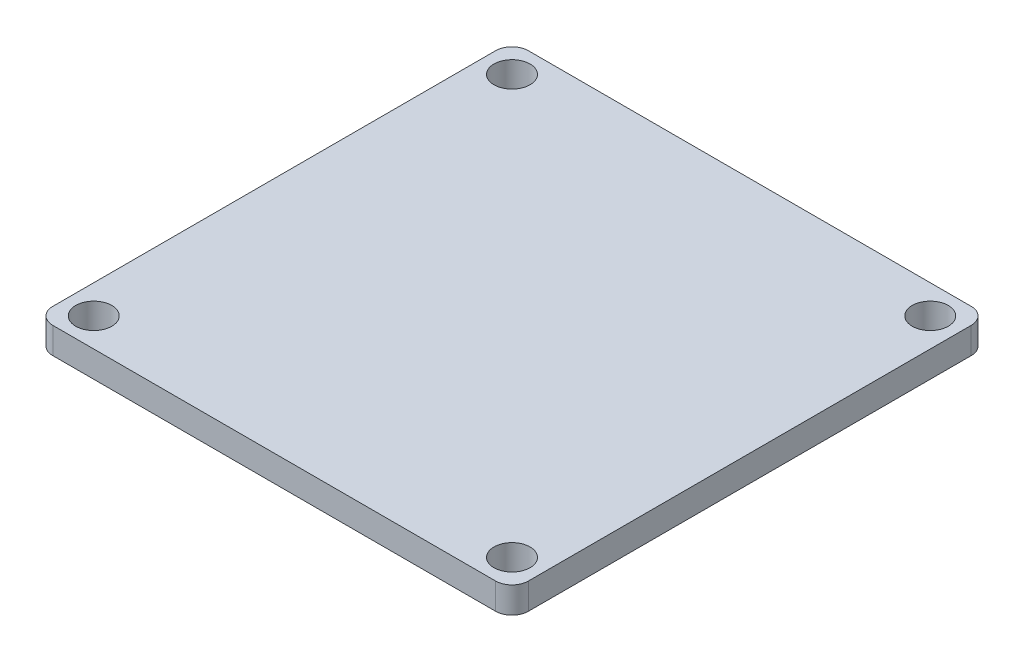
ISO-10303-21;
HEADER;
FILE_DESCRIPTION(('STEP AP214'),'2;1');
FILE_NAME('part.step','',(''),(''),'','','');
FILE_SCHEMA(('AUTOMOTIVE_DESIGN { 1 0 10303 214 1 1 1 1 }'));
ENDSEC;
DATA;
#1=APPLICATION_CONTEXT('core data for automotive mechanical design processes');
#2=APPLICATION_PROTOCOL_DEFINITION('international standard','automotive_design',2000,#1);
#3=PRODUCT_CONTEXT('',#1,'mechanical');
#4=PRODUCT('Part','Part','',(#3));
#5=PRODUCT_RELATED_PRODUCT_CATEGORY('part','',(#4));
#6=PRODUCT_DEFINITION_FORMATION('','',#4);
#7=PRODUCT_DEFINITION_CONTEXT('part definition',#1,'design');
#8=PRODUCT_DEFINITION('design','',#6,#7);
#9=PRODUCT_DEFINITION_SHAPE('','',#8);
#10=(LENGTH_UNIT() NAMED_UNIT(*) SI_UNIT(.MILLI.,.METRE.));
#11=(NAMED_UNIT(*) PLANE_ANGLE_UNIT() SI_UNIT($,.RADIAN.));
#12=(NAMED_UNIT(*) SI_UNIT($,.STERADIAN.) SOLID_ANGLE_UNIT());
#13=UNCERTAINTY_MEASURE_WITH_UNIT(LENGTH_MEASURE(1.E-05),#10,'distance_accuracy_value','');
#14=(GEOMETRIC_REPRESENTATION_CONTEXT(3) GLOBAL_UNCERTAINTY_ASSIGNED_CONTEXT((#13)) GLOBAL_UNIT_ASSIGNED_CONTEXT((#10,
#11,#12)) REPRESENTATION_CONTEXT('',''));
#15=CARTESIAN_POINT('',(0.,0.,0.));
#16=DIRECTION('',(0.,0.,1.));
#17=DIRECTION('',(1.,0.,0.));
#18=AXIS2_PLACEMENT_3D('',#15,#16,#17);
#19=CARTESIAN_POINT('',(0.,1.6,0.));
#20=DIRECTION('',(0.,-1.,0.));
#21=DIRECTION('',(0.,0.,-1.));
#22=AXIS2_PLACEMENT_3D('',#19,#20,#21);
#23=PLANE('',#22);
#24=DIRECTION('',(-1.,0.,0.));
#25=VECTOR('',#24,1.);
#26=CARTESIAN_POINT('',(-14.5,1.6,-14.5));
#27=LINE('',#26,#25);
#28=CARTESIAN_POINT('',(13.5,1.6,-14.5));
#29=VERTEX_POINT('',#28);
#30=CARTESIAN_POINT('',(-13.5,1.6,-14.5));
#31=VERTEX_POINT('',#30);
#32=EDGE_CURVE('E172',#29,#31,#27,.T.);
#33=ORIENTED_EDGE('',*,*,#32,.T.);
#34=CARTESIAN_POINT('',(-13.5,1.6,-13.5));
#35=DIRECTION('',(0.,-1.,0.));
#36=DIRECTION('',(0.,0.,-1.));
#37=AXIS2_PLACEMENT_3D('',#34,#35,#36);
#38=CIRCLE('',#37,1.);
#39=CARTESIAN_POINT('',(-14.5,1.6,-13.5));
#40=VERTEX_POINT('',#39);
#41=EDGE_CURVE('E150',#31,#40,#38,.F.);
#42=ORIENTED_EDGE('',*,*,#41,.T.);
#43=DIRECTION('',(0.,0.,1.));
#44=VECTOR('',#43,1.);
#45=CARTESIAN_POINT('',(-14.5,1.6,14.5));
#46=LINE('',#45,#44);
#47=CARTESIAN_POINT('',(-14.5,1.6,13.5));
#48=VERTEX_POINT('',#47);
#49=EDGE_CURVE('E120',#40,#48,#46,.T.);
#50=ORIENTED_EDGE('',*,*,#49,.T.);
#51=CARTESIAN_POINT('',(-13.5,1.6,13.5));
#52=DIRECTION('',(0.,-1.,0.));
#53=DIRECTION('',(0.,0.,-1.));
#54=AXIS2_PLACEMENT_3D('',#51,#52,#53);
#55=CIRCLE('',#54,1.);
#56=CARTESIAN_POINT('',(-13.5,1.6,14.5));
#57=VERTEX_POINT('',#56);
#58=EDGE_CURVE('E56',#48,#57,#55,.F.);
#59=ORIENTED_EDGE('',*,*,#58,.T.);
#60=DIRECTION('',(1.,0.,0.));
#61=VECTOR('',#60,1.);
#62=CARTESIAN_POINT('',(-14.5,1.6,14.5));
#63=LINE('',#62,#61);
#64=CARTESIAN_POINT('',(13.5,1.6,14.5));
#65=VERTEX_POINT('',#64);
#66=EDGE_CURVE('E136',#57,#65,#63,.T.);
#67=ORIENTED_EDGE('',*,*,#66,.T.);
#68=CARTESIAN_POINT('',(13.5,1.6,13.5));
#69=DIRECTION('',(0.,-1.,0.));
#70=DIRECTION('',(0.,0.,-1.));
#71=AXIS2_PLACEMENT_3D('',#68,#69,#70);
#72=CIRCLE('',#71,1.);
#73=CARTESIAN_POINT('',(14.5,1.6,13.5));
#74=VERTEX_POINT('',#73);
#75=EDGE_CURVE('E146',#65,#74,#72,.F.);
#76=ORIENTED_EDGE('',*,*,#75,.T.);
#77=DIRECTION('',(0.,0.,-1.));
#78=VECTOR('',#77,1.);
#79=CARTESIAN_POINT('',(14.5,1.6,14.5));
#80=LINE('',#79,#78);
#81=CARTESIAN_POINT('',(14.5,1.6,-13.5));
#82=VERTEX_POINT('',#81);
#83=EDGE_CURVE('E130',#74,#82,#80,.T.);
#84=ORIENTED_EDGE('',*,*,#83,.T.);
#85=CARTESIAN_POINT('',(13.5,1.6,-13.5));
#86=DIRECTION('',(0.,-1.,0.));
#87=DIRECTION('',(0.,0.,-1.));
#88=AXIS2_PLACEMENT_3D('',#85,#86,#87);
#89=CIRCLE('',#88,1.);
#90=EDGE_CURVE('E148',#82,#29,#89,.F.);
#91=ORIENTED_EDGE('',*,*,#90,.T.);
#92=EDGE_LOOP('',(#33,#42,#50,#59,#67,#76,#84,#91));
#93=FACE_BOUND('',#92,.T.);
#94=CARTESIAN_POINT('',(-12.75,1.6,-12.75));
#95=DIRECTION('',(0.,1.,0.));
#96=DIRECTION('',(0.,0.,1.));
#97=AXIS2_PLACEMENT_3D('',#94,#95,#96);
#98=CIRCLE('',#97,1.1);
#99=CARTESIAN_POINT('',(-12.75,1.6,-11.65));
#100=VERTEX_POINT('',#99);
#101=EDGE_CURVE('E181',#100,#100,#98,.T.);
#102=ORIENTED_EDGE('',*,*,#101,.F.);
#103=EDGE_LOOP('',(#102));
#104=FACE_BOUND('',#103,.T.);
#105=CARTESIAN_POINT('',(12.75,1.6,-12.75));
#106=DIRECTION('',(0.,1.,0.));
#107=DIRECTION('',(0.,0.,1.));
#108=AXIS2_PLACEMENT_3D('',#105,#106,#107);
#109=CIRCLE('',#108,1.1);
#110=CARTESIAN_POINT('',(12.75,1.6,-11.65));
#111=VERTEX_POINT('',#110);
#112=EDGE_CURVE('E186',#111,#111,#109,.T.);
#113=ORIENTED_EDGE('',*,*,#112,.F.);
#114=EDGE_LOOP('',(#113));
#115=FACE_BOUND('',#114,.T.);
#116=CARTESIAN_POINT('',(12.75,1.6,12.75));
#117=DIRECTION('',(0.,1.,0.));
#118=DIRECTION('',(0.,0.,1.));
#119=AXIS2_PLACEMENT_3D('',#116,#117,#118);
#120=CIRCLE('',#119,1.1);
#121=CARTESIAN_POINT('',(12.75,1.6,13.85));
#122=VERTEX_POINT('',#121);
#123=EDGE_CURVE('E191',#122,#122,#120,.T.);
#124=ORIENTED_EDGE('',*,*,#123,.F.);
#125=EDGE_LOOP('',(#124));
#126=FACE_BOUND('',#125,.T.);
#127=CARTESIAN_POINT('',(-12.75,1.6,12.75));
#128=DIRECTION('',(0.,1.,0.));
#129=DIRECTION('',(0.,0.,1.));
#130=AXIS2_PLACEMENT_3D('',#127,#128,#129);
#131=CIRCLE('',#130,1.1);
#132=CARTESIAN_POINT('',(-12.75,1.6,13.85));
#133=VERTEX_POINT('',#132);
#134=EDGE_CURVE('E197',#133,#133,#131,.T.);
#135=ORIENTED_EDGE('',*,*,#134,.F.);
#136=EDGE_LOOP('',(#135));
#137=FACE_BOUND('',#136,.T.);
#138=ADVANCED_FACE('F36',(#93,#104,#115,#126,#137),#23,.F.);
#139=CARTESIAN_POINT('',(0.,0.,0.));
#140=DIRECTION('',(0.,-1.,0.));
#141=DIRECTION('',(0.,0.,-1.));
#142=AXIS2_PLACEMENT_3D('',#139,#140,#141);
#143=PLANE('',#142);
#144=CARTESIAN_POINT('',(12.75,0.,12.75));
#145=DIRECTION('',(0.,1.,0.));
#146=DIRECTION('',(0.,0.,1.));
#147=AXIS2_PLACEMENT_3D('',#144,#145,#146);
#148=CIRCLE('',#147,1.1);
#149=CARTESIAN_POINT('',(12.75,0.,13.85));
#150=VERTEX_POINT('',#149);
#151=EDGE_CURVE('E194',#150,#150,#148,.T.);
#152=ORIENTED_EDGE('',*,*,#151,.T.);
#153=EDGE_LOOP('',(#152));
#154=FACE_BOUND('',#153,.T.);
#155=CARTESIAN_POINT('',(-12.75,0.,-12.75));
#156=DIRECTION('',(0.,1.,0.));
#157=DIRECTION('',(0.,0.,1.));
#158=AXIS2_PLACEMENT_3D('',#155,#156,#157);
#159=CIRCLE('',#158,1.1);
#160=CARTESIAN_POINT('',(-12.75,0.,-11.65));
#161=VERTEX_POINT('',#160);
#162=EDGE_CURVE('E177',#161,#161,#159,.T.);
#163=ORIENTED_EDGE('',*,*,#162,.T.);
#164=EDGE_LOOP('',(#163));
#165=FACE_BOUND('',#164,.T.);
#166=DIRECTION('',(0.,0.,1.));
#167=VECTOR('',#166,1.);
#168=CARTESIAN_POINT('',(-14.5,0.,14.5));
#169=LINE('',#168,#167);
#170=CARTESIAN_POINT('',(-14.5,0.,-13.5));
#171=VERTEX_POINT('',#170);
#172=CARTESIAN_POINT('',(-14.5,0.,13.5));
#173=VERTEX_POINT('',#172);
#174=EDGE_CURVE('E118',#171,#173,#169,.T.);
#175=ORIENTED_EDGE('',*,*,#174,.F.);
#176=CARTESIAN_POINT('',(-13.5,0.,-13.5));
#177=DIRECTION('',(0.,-1.,0.));
#178=DIRECTION('',(0.,0.,-1.));
#179=AXIS2_PLACEMENT_3D('',#176,#177,#178);
#180=CIRCLE('',#179,1.);
#181=CARTESIAN_POINT('',(-13.5,0.,-14.5));
#182=VERTEX_POINT('',#181);
#183=EDGE_CURVE('E101',#171,#182,#180,.T.);
#184=ORIENTED_EDGE('',*,*,#183,.T.);
#185=DIRECTION('',(-1.,0.,0.));
#186=VECTOR('',#185,1.);
#187=CARTESIAN_POINT('',(-14.5,0.,-14.5));
#188=LINE('',#187,#186);
#189=CARTESIAN_POINT('',(13.5,0.,-14.5));
#190=VERTEX_POINT('',#189);
#191=EDGE_CURVE('E128',#190,#182,#188,.T.);
#192=ORIENTED_EDGE('',*,*,#191,.F.);
#193=CARTESIAN_POINT('',(13.5,0.,-13.5));
#194=DIRECTION('',(0.,-1.,0.));
#195=DIRECTION('',(0.,0.,-1.));
#196=AXIS2_PLACEMENT_3D('',#193,#194,#195);
#197=CIRCLE('',#196,1.);
#198=CARTESIAN_POINT('',(14.5,0.,-13.5));
#199=VERTEX_POINT('',#198);
#200=EDGE_CURVE('E112',#190,#199,#197,.T.);
#201=ORIENTED_EDGE('',*,*,#200,.T.);
#202=DIRECTION('',(0.,0.,-1.));
#203=VECTOR('',#202,1.);
#204=CARTESIAN_POINT('',(14.5,0.,14.5));
#205=LINE('',#204,#203);
#206=CARTESIAN_POINT('',(14.5,0.,13.5));
#207=VERTEX_POINT('',#206);
#208=EDGE_CURVE('E132',#207,#199,#205,.T.);
#209=ORIENTED_EDGE('',*,*,#208,.F.);
#210=CARTESIAN_POINT('',(13.5,0.,13.5));
#211=DIRECTION('',(0.,-1.,0.));
#212=DIRECTION('',(0.,0.,-1.));
#213=AXIS2_PLACEMENT_3D('',#210,#211,#212);
#214=CIRCLE('',#213,1.);
#215=CARTESIAN_POINT('',(13.5,0.,14.5));
#216=VERTEX_POINT('',#215);
#217=EDGE_CURVE('E139',#207,#216,#214,.T.);
#218=ORIENTED_EDGE('',*,*,#217,.T.);
#219=DIRECTION('',(1.,0.,0.));
#220=VECTOR('',#219,1.);
#221=CARTESIAN_POINT('',(-14.5,0.,14.5));
#222=LINE('',#221,#220);
#223=CARTESIAN_POINT('',(-13.5,0.,14.5));
#224=VERTEX_POINT('',#223);
#225=EDGE_CURVE('E127',#224,#216,#222,.T.);
#226=ORIENTED_EDGE('',*,*,#225,.F.);
#227=CARTESIAN_POINT('',(-13.5,0.,13.5));
#228=DIRECTION('',(0.,-1.,0.));
#229=DIRECTION('',(0.,0.,-1.));
#230=AXIS2_PLACEMENT_3D('',#227,#228,#229);
#231=CIRCLE('',#230,1.);
#232=EDGE_CURVE('E121',#224,#173,#231,.T.);
#233=ORIENTED_EDGE('',*,*,#232,.T.);
#234=EDGE_LOOP('',(#175,#184,#192,#201,#209,#218,#226,#233));
#235=FACE_BOUND('',#234,.T.);
#236=CARTESIAN_POINT('',(12.75,0.,-12.75));
#237=DIRECTION('',(0.,1.,0.));
#238=DIRECTION('',(0.,0.,1.));
#239=AXIS2_PLACEMENT_3D('',#236,#237,#238);
#240=CIRCLE('',#239,1.1);
#241=CARTESIAN_POINT('',(12.75,0.,-11.65));
#242=VERTEX_POINT('',#241);
#243=EDGE_CURVE('E188',#242,#242,#240,.T.);
#244=ORIENTED_EDGE('',*,*,#243,.T.);
#245=EDGE_LOOP('',(#244));
#246=FACE_BOUND('',#245,.T.);
#247=CARTESIAN_POINT('',(-12.75,0.,12.75));
#248=DIRECTION('',(0.,1.,0.));
#249=DIRECTION('',(0.,0.,1.));
#250=AXIS2_PLACEMENT_3D('',#247,#248,#249);
#251=CIRCLE('',#250,1.1);
#252=CARTESIAN_POINT('',(-12.75,0.,13.85));
#253=VERTEX_POINT('',#252);
#254=EDGE_CURVE('E200',#253,#253,#251,.T.);
#255=ORIENTED_EDGE('',*,*,#254,.T.);
#256=EDGE_LOOP('',(#255));
#257=FACE_BOUND('',#256,.T.);
#258=ADVANCED_FACE('F124',(#154,#165,#235,#246,#257),#143,.T.);
#259=CARTESIAN_POINT('',(14.5,1.6,14.5));
#260=DIRECTION('',(-1.,0.,0.));
#261=DIRECTION('',(0.,0.,1.));
#262=AXIS2_PLACEMENT_3D('',#259,#260,#261);
#263=PLANE('',#262);
#264=ORIENTED_EDGE('',*,*,#208,.T.);
#265=DIRECTION('',(0.,-1.,0.));
#266=VECTOR('',#265,1.);
#267=CARTESIAN_POINT('',(14.5,1.6,-13.5));
#268=LINE('',#267,#266);
#269=EDGE_CURVE('E155',#199,#82,#268,.F.);
#270=ORIENTED_EDGE('',*,*,#269,.T.);
#271=ORIENTED_EDGE('',*,*,#83,.F.);
#272=DIRECTION('',(0.,-1.,0.));
#273=VECTOR('',#272,1.);
#274=CARTESIAN_POINT('',(14.5,1.6,13.5));
#275=LINE('',#274,#273);
#276=EDGE_CURVE('E152',#74,#207,#275,.T.);
#277=ORIENTED_EDGE('',*,*,#276,.T.);
#278=EDGE_LOOP('',(#264,#270,#271,#277));
#279=FACE_BOUND('',#278,.T.);
#280=ADVANCED_FACE('F168',(#279),#263,.F.);
#281=CARTESIAN_POINT('',(-14.5,1.6,-14.5));
#282=DIRECTION('',(0.,0.,1.));
#283=DIRECTION('',(1.,0.,0.));
#284=AXIS2_PLACEMENT_3D('',#281,#282,#283);
#285=PLANE('',#284);
#286=ORIENTED_EDGE('',*,*,#191,.T.);
#287=DIRECTION('',(0.,-1.,0.));
#288=VECTOR('',#287,1.);
#289=CARTESIAN_POINT('',(-13.5,1.6,-14.5));
#290=LINE('',#289,#288);
#291=EDGE_CURVE('E106',#182,#31,#290,.F.);
#292=ORIENTED_EDGE('',*,*,#291,.T.);
#293=ORIENTED_EDGE('',*,*,#32,.F.);
#294=DIRECTION('',(0.,-1.,0.));
#295=VECTOR('',#294,1.);
#296=CARTESIAN_POINT('',(13.5,1.6,-14.5));
#297=LINE('',#296,#295);
#298=EDGE_CURVE('E111',#29,#190,#297,.T.);
#299=ORIENTED_EDGE('',*,*,#298,.T.);
#300=EDGE_LOOP('',(#286,#292,#293,#299));
#301=FACE_BOUND('',#300,.T.);
#302=ADVANCED_FACE('F225',(#301),#285,.F.);
#303=CARTESIAN_POINT('',(-14.5,1.6,14.5));
#304=DIRECTION('',(1.,0.,0.));
#305=DIRECTION('',(0.,0.,-1.));
#306=AXIS2_PLACEMENT_3D('',#303,#304,#305);
#307=PLANE('',#306);
#308=ORIENTED_EDGE('',*,*,#49,.F.);
#309=DIRECTION('',(0.,-1.,0.));
#310=VECTOR('',#309,1.);
#311=CARTESIAN_POINT('',(-14.5,1.6,-13.5));
#312=LINE('',#311,#310);
#313=EDGE_CURVE('E105',#40,#171,#312,.T.);
#314=ORIENTED_EDGE('',*,*,#313,.T.);
#315=ORIENTED_EDGE('',*,*,#174,.T.);
#316=DIRECTION('',(0.,-1.,0.));
#317=VECTOR('',#316,1.);
#318=CARTESIAN_POINT('',(-14.5,1.6,13.5));
#319=LINE('',#318,#317);
#320=EDGE_CURVE('E122',#173,#48,#319,.F.);
#321=ORIENTED_EDGE('',*,*,#320,.T.);
#322=EDGE_LOOP('',(#308,#314,#315,#321));
#323=FACE_BOUND('',#322,.T.);
#324=ADVANCED_FACE('F117',(#323),#307,.F.);
#325=CARTESIAN_POINT('',(-14.5,1.6,14.5));
#326=DIRECTION('',(0.,0.,-1.));
#327=DIRECTION('',(-1.,0.,0.));
#328=AXIS2_PLACEMENT_3D('',#325,#326,#327);
#329=PLANE('',#328);
#330=ORIENTED_EDGE('',*,*,#225,.T.);
#331=DIRECTION('',(0.,-1.,0.));
#332=VECTOR('',#331,1.);
#333=CARTESIAN_POINT('',(13.5,1.6,14.5));
#334=LINE('',#333,#332);
#335=EDGE_CURVE('E11',#216,#65,#334,.F.);
#336=ORIENTED_EDGE('',*,*,#335,.T.);
#337=ORIENTED_EDGE('',*,*,#66,.F.);
#338=DIRECTION('',(0.,-1.,0.));
#339=VECTOR('',#338,1.);
#340=CARTESIAN_POINT('',(-13.5,1.6,14.5));
#341=LINE('',#340,#339);
#342=EDGE_CURVE('E44',#57,#224,#341,.T.);
#343=ORIENTED_EDGE('',*,*,#342,.T.);
#344=EDGE_LOOP('',(#330,#336,#337,#343));
#345=FACE_BOUND('',#344,.T.);
#346=ADVANCED_FACE('F158',(#345),#329,.F.);
#347=CARTESIAN_POINT('',(-12.75,1.6,-12.75));
#348=DIRECTION('',(0.,-1.,0.));
#349=DIRECTION('',(0.,0.,-1.));
#350=AXIS2_PLACEMENT_3D('',#347,#348,#349);
#351=CYLINDRICAL_SURFACE('',#350,1.1);
#352=ORIENTED_EDGE('',*,*,#101,.T.);
#353=EDGE_LOOP('',(#352));
#354=FACE_BOUND('',#353,.T.);
#355=ORIENTED_EDGE('',*,*,#162,.F.);
#356=EDGE_LOOP('',(#355));
#357=FACE_BOUND('',#356,.T.);
#358=ADVANCED_FACE('F218',(#354,#357),#351,.F.);
#359=CARTESIAN_POINT('',(12.75,1.6,-12.75));
#360=DIRECTION('',(0.,-1.,0.));
#361=DIRECTION('',(0.,0.,-1.));
#362=AXIS2_PLACEMENT_3D('',#359,#360,#361);
#363=CYLINDRICAL_SURFACE('',#362,1.1);
#364=ORIENTED_EDGE('',*,*,#112,.T.);
#365=EDGE_LOOP('',(#364));
#366=FACE_BOUND('',#365,.T.);
#367=ORIENTED_EDGE('',*,*,#243,.F.);
#368=EDGE_LOOP('',(#367));
#369=FACE_BOUND('',#368,.T.);
#370=ADVANCED_FACE('F314',(#366,#369),#363,.F.);
#371=CARTESIAN_POINT('',(12.75,1.6,12.75));
#372=DIRECTION('',(0.,-1.,0.));
#373=DIRECTION('',(0.,0.,-1.));
#374=AXIS2_PLACEMENT_3D('',#371,#372,#373);
#375=CYLINDRICAL_SURFACE('',#374,1.1);
#376=ORIENTED_EDGE('',*,*,#123,.T.);
#377=EDGE_LOOP('',(#376));
#378=FACE_BOUND('',#377,.T.);
#379=ORIENTED_EDGE('',*,*,#151,.F.);
#380=EDGE_LOOP('',(#379));
#381=FACE_BOUND('',#380,.T.);
#382=ADVANCED_FACE('F305',(#378,#381),#375,.F.);
#383=CARTESIAN_POINT('',(-12.75,1.6,12.75));
#384=DIRECTION('',(0.,-1.,0.));
#385=DIRECTION('',(0.,0.,-1.));
#386=AXIS2_PLACEMENT_3D('',#383,#384,#385);
#387=CYLINDRICAL_SURFACE('',#386,1.1);
#388=ORIENTED_EDGE('',*,*,#134,.T.);
#389=EDGE_LOOP('',(#388));
#390=FACE_BOUND('',#389,.T.);
#391=ORIENTED_EDGE('',*,*,#254,.F.);
#392=EDGE_LOOP('',(#391));
#393=FACE_BOUND('',#392,.T.);
#394=ADVANCED_FACE('F206',(#390,#393),#387,.F.);
#395=CARTESIAN_POINT('',(-13.5,1.6,-13.5));
#396=DIRECTION('',(0.,-1.,0.));
#397=DIRECTION('',(0.,0.,-1.));
#398=AXIS2_PLACEMENT_3D('',#395,#396,#397);
#399=CYLINDRICAL_SURFACE('',#398,1.);
#400=ORIENTED_EDGE('',*,*,#41,.F.);
#401=ORIENTED_EDGE('',*,*,#291,.F.);
#402=ORIENTED_EDGE('',*,*,#183,.F.);
#403=ORIENTED_EDGE('',*,*,#313,.F.);
#404=EDGE_LOOP('',(#400,#401,#402,#403));
#405=FACE_BOUND('',#404,.T.);
#406=ADVANCED_FACE('F104',(#405),#399,.T.);
#407=CARTESIAN_POINT('',(13.5,1.6,-13.5));
#408=DIRECTION('',(0.,-1.,0.));
#409=DIRECTION('',(0.,0.,-1.));
#410=AXIS2_PLACEMENT_3D('',#407,#408,#409);
#411=CYLINDRICAL_SURFACE('',#410,1.);
#412=ORIENTED_EDGE('',*,*,#90,.F.);
#413=ORIENTED_EDGE('',*,*,#269,.F.);
#414=ORIENTED_EDGE('',*,*,#200,.F.);
#415=ORIENTED_EDGE('',*,*,#298,.F.);
#416=EDGE_LOOP('',(#412,#413,#414,#415));
#417=FACE_BOUND('',#416,.T.);
#418=ADVANCED_FACE('F233',(#417),#411,.T.);
#419=CARTESIAN_POINT('',(13.5,1.6,13.5));
#420=DIRECTION('',(0.,-1.,0.));
#421=DIRECTION('',(0.,0.,-1.));
#422=AXIS2_PLACEMENT_3D('',#419,#420,#421);
#423=CYLINDRICAL_SURFACE('',#422,1.);
#424=ORIENTED_EDGE('',*,*,#75,.F.);
#425=ORIENTED_EDGE('',*,*,#335,.F.);
#426=ORIENTED_EDGE('',*,*,#217,.F.);
#427=ORIENTED_EDGE('',*,*,#276,.F.);
#428=EDGE_LOOP('',(#424,#425,#426,#427));
#429=FACE_BOUND('',#428,.T.);
#430=ADVANCED_FACE('F165',(#429),#423,.T.);
#431=CARTESIAN_POINT('',(-13.5,1.6,13.5));
#432=DIRECTION('',(0.,-1.,0.));
#433=DIRECTION('',(0.,0.,-1.));
#434=AXIS2_PLACEMENT_3D('',#431,#432,#433);
#435=CYLINDRICAL_SURFACE('',#434,1.);
#436=ORIENTED_EDGE('',*,*,#58,.F.);
#437=ORIENTED_EDGE('',*,*,#320,.F.);
#438=ORIENTED_EDGE('',*,*,#232,.F.);
#439=ORIENTED_EDGE('',*,*,#342,.F.);
#440=EDGE_LOOP('',(#436,#437,#438,#439));
#441=FACE_BOUND('',#440,.T.);
#442=ADVANCED_FACE('F38',(#441),#435,.T.);
#443=CLOSED_SHELL('',(#138,#258,#280,#302,#324,#346,#358,#370,#382,#394,#406,#418,#430,#442));
#444=MANIFOLD_SOLID_BREP('B2',#443);
#445=ADVANCED_BREP_SHAPE_REPRESENTATION('',(#18,#444),#14);
#446=SHAPE_DEFINITION_REPRESENTATION(#9,#445);
ENDSEC;
END-ISO-10303-21;
